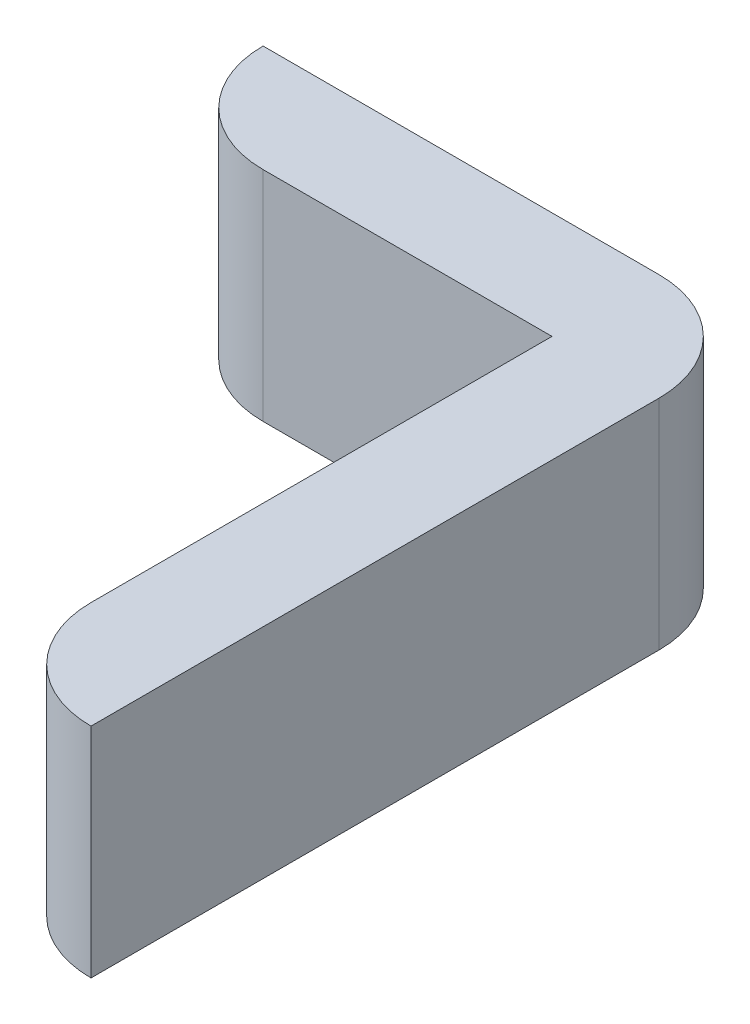
ISO-10303-21;
HEADER;
FILE_DESCRIPTION(('STEP AP214'),'2;1');
FILE_NAME('part.step','',(''),(''),'','','');
FILE_SCHEMA(('AUTOMOTIVE_DESIGN { 1 0 10303 214 1 1 1 1 }'));
ENDSEC;
DATA;
#1=APPLICATION_CONTEXT('core data for automotive mechanical design processes');
#2=APPLICATION_PROTOCOL_DEFINITION('international standard','automotive_design',2000,#1);
#3=PRODUCT_CONTEXT('',#1,'mechanical');
#4=PRODUCT('Part','Part','',(#3));
#5=PRODUCT_RELATED_PRODUCT_CATEGORY('part','',(#4));
#6=PRODUCT_DEFINITION_FORMATION('','',#4);
#7=PRODUCT_DEFINITION_CONTEXT('part definition',#1,'design');
#8=PRODUCT_DEFINITION('design','',#6,#7);
#9=PRODUCT_DEFINITION_SHAPE('','',#8);
#10=(LENGTH_UNIT() NAMED_UNIT(*) SI_UNIT(.MILLI.,.METRE.));
#11=(NAMED_UNIT(*) PLANE_ANGLE_UNIT() SI_UNIT($,.RADIAN.));
#12=(NAMED_UNIT(*) SI_UNIT($,.STERADIAN.) SOLID_ANGLE_UNIT());
#13=UNCERTAINTY_MEASURE_WITH_UNIT(LENGTH_MEASURE(1.E-05),#10,'distance_accuracy_value','');
#14=(GEOMETRIC_REPRESENTATION_CONTEXT(3) GLOBAL_UNCERTAINTY_ASSIGNED_CONTEXT((#13)) GLOBAL_UNIT_ASSIGNED_CONTEXT((#10,
#11,#12)) REPRESENTATION_CONTEXT('',''));
#15=CARTESIAN_POINT('',(0.,0.,0.));
#16=DIRECTION('',(0.,0.,1.));
#17=DIRECTION('',(1.,0.,0.));
#18=AXIS2_PLACEMENT_3D('',#15,#16,#17);
#19=CARTESIAN_POINT('',(-0.125,-2.2852,0.));
#20=DIRECTION('',(0.,-1.,0.));
#21=DIRECTION('',(0.,0.,-1.));
#22=AXIS2_PLACEMENT_3D('',#19,#20,#21);
#23=PLANE('',#22);
#24=DIRECTION('',(-1.,0.,0.));
#25=VECTOR('',#24,1.);
#26=CARTESIAN_POINT('',(0.125,-2.2852,0.25));
#27=LINE('',#26,#25);
#28=CARTESIAN_POINT('',(0.125,-2.2852,0.25));
#29=VERTEX_POINT('',#28);
#30=CARTESIAN_POINT('',(0.8,-2.2852,0.25));
#31=VERTEX_POINT('',#30);
#32=EDGE_CURVE('E102',#29,#31,#27,.F.);
#33=ORIENTED_EDGE('',*,*,#32,.T.);
#34=DIRECTION('',(0.,0.,-1.));
#35=VECTOR('',#34,1.);
#36=CARTESIAN_POINT('',(0.8,-2.2852,0.25));
#37=LINE('',#36,#35);
#38=CARTESIAN_POINT('',(0.8,-2.2852,1.327));
#39=VERTEX_POINT('',#38);
#40=EDGE_CURVE('E108',#31,#39,#37,.F.);
#41=ORIENTED_EDGE('',*,*,#40,.T.);
#42=CARTESIAN_POINT('',(1.05,-2.2852,1.327));
#43=DIRECTION('',(0.,-1.,0.));
#44=DIRECTION('',(0.,0.,-1.));
#45=AXIS2_PLACEMENT_3D('',#42,#43,#44);
#46=CIRCLE('',#45,0.25);
#47=CARTESIAN_POINT('',(1.05,-2.2852,1.577));
#48=VERTEX_POINT('',#47);
#49=EDGE_CURVE('E80',#48,#39,#46,.T.);
#50=ORIENTED_EDGE('',*,*,#49,.F.);
#51=DIRECTION('',(0.,0.,1.));
#52=VECTOR('',#51,1.);
#53=CARTESIAN_POINT('',(1.05,-2.2852,1.577));
#54=LINE('',#53,#52);
#55=CARTESIAN_POINT('',(1.05,-2.2852,0.25));
#56=VERTEX_POINT('',#55);
#57=EDGE_CURVE('E75',#48,#56,#54,.F.);
#58=ORIENTED_EDGE('',*,*,#57,.T.);
#59=CARTESIAN_POINT('',(0.8,-2.2852,0.25));
#60=DIRECTION('',(0.,-1.,0.));
#61=DIRECTION('',(0.,0.,-1.));
#62=AXIS2_PLACEMENT_3D('',#59,#60,#61);
#63=CIRCLE('',#62,0.25);
#64=CARTESIAN_POINT('',(0.8,-2.2852,0.));
#65=VERTEX_POINT('',#64);
#66=EDGE_CURVE('E19',#65,#56,#63,.T.);
#67=ORIENTED_EDGE('',*,*,#66,.F.);
#68=DIRECTION('',(1.,0.,0.));
#69=VECTOR('',#68,1.);
#70=CARTESIAN_POINT('',(0.8,-2.2852,0.));
#71=LINE('',#70,#69);
#72=CARTESIAN_POINT('',(-0.125,-2.2852,0.));
#73=VERTEX_POINT('',#72);
#74=EDGE_CURVE('E70',#65,#73,#71,.F.);
#75=ORIENTED_EDGE('',*,*,#74,.T.);
#76=CARTESIAN_POINT('',(0.125,-2.2852,0.));
#77=DIRECTION('',(0.,-1.,0.));
#78=DIRECTION('',(0.,0.,-1.));
#79=AXIS2_PLACEMENT_3D('',#76,#77,#78);
#80=CIRCLE('',#79,0.25);
#81=EDGE_CURVE('E121',#29,#73,#80,.T.);
#82=ORIENTED_EDGE('',*,*,#81,.F.);
#83=EDGE_LOOP('',(#33,#41,#50,#58,#67,#75,#82));
#84=FACE_BOUND('',#83,.T.);
#85=ADVANCED_FACE('F16',(#84),#23,.F.);
#86=CARTESIAN_POINT('',(0.8,-2.7948,0.));
#87=DIRECTION('',(0.,0.,1.));
#88=DIRECTION('',(1.,0.,0.));
#89=AXIS2_PLACEMENT_3D('',#86,#87,#88);
#90=PLANE('',#89);
#91=DIRECTION('',(0.,-1.,0.));
#92=VECTOR('',#91,1.);
#93=CARTESIAN_POINT('',(-0.125,-2.7948,0.));
#94=LINE('',#93,#92);
#95=CARTESIAN_POINT('',(-0.125,-2.7948,0.));
#96=VERTEX_POINT('',#95);
#97=EDGE_CURVE('E123',#73,#96,#94,.T.);
#98=ORIENTED_EDGE('',*,*,#97,.F.);
#99=ORIENTED_EDGE('',*,*,#74,.F.);
#100=DIRECTION('',(0.,-1.,0.));
#101=VECTOR('',#100,1.);
#102=CARTESIAN_POINT('',(0.8,-2.7948,0.));
#103=LINE('',#102,#101);
#104=CARTESIAN_POINT('',(0.8,-2.7948,0.));
#105=VERTEX_POINT('',#104);
#106=EDGE_CURVE('E92',#105,#65,#103,.F.);
#107=ORIENTED_EDGE('',*,*,#106,.F.);
#108=DIRECTION('',(1.,0.,0.));
#109=VECTOR('',#108,1.);
#110=CARTESIAN_POINT('',(-0.125,-2.7948,0.));
#111=LINE('',#110,#109);
#112=EDGE_CURVE('E120',#96,#105,#111,.T.);
#113=ORIENTED_EDGE('',*,*,#112,.F.);
#114=EDGE_LOOP('',(#98,#99,#107,#113));
#115=FACE_BOUND('',#114,.T.);
#116=ADVANCED_FACE('F158',(#115),#90,.F.);
#117=CARTESIAN_POINT('',(0.8,-2.7948,0.25));
#118=DIRECTION('',(0.,-1.,0.));
#119=DIRECTION('',(0.,0.,-1.));
#120=AXIS2_PLACEMENT_3D('',#117,#118,#119);
#121=CYLINDRICAL_SURFACE('',#120,0.25);
#122=ORIENTED_EDGE('',*,*,#66,.T.);
#123=DIRECTION('',(0.,1.,0.));
#124=VECTOR('',#123,1.);
#125=CARTESIAN_POINT('',(1.05,-2.7948,0.25));
#126=LINE('',#125,#124);
#127=CARTESIAN_POINT('',(1.05,-2.7948,0.25));
#128=VERTEX_POINT('',#127);
#129=EDGE_CURVE('E86',#56,#128,#126,.F.);
#130=ORIENTED_EDGE('',*,*,#129,.T.);
#131=CARTESIAN_POINT('',(0.8,-2.7948,0.25));
#132=DIRECTION('',(0.,-1.,0.));
#133=DIRECTION('',(0.,0.,-1.));
#134=AXIS2_PLACEMENT_3D('',#131,#132,#133);
#135=CIRCLE('',#134,0.25);
#136=EDGE_CURVE('E118',#105,#128,#135,.T.);
#137=ORIENTED_EDGE('',*,*,#136,.F.);
#138=ORIENTED_EDGE('',*,*,#106,.T.);
#139=EDGE_LOOP('',(#122,#130,#137,#138));
#140=FACE_BOUND('',#139,.T.);
#141=ADVANCED_FACE('F89',(#140),#121,.T.);
#142=CARTESIAN_POINT('',(1.05,-2.7948,1.577));
#143=DIRECTION('',(-1.,0.,0.));
#144=DIRECTION('',(0.,0.,1.));
#145=AXIS2_PLACEMENT_3D('',#142,#143,#144);
#146=PLANE('',#145);
#147=DIRECTION('',(0.,-1.,0.));
#148=VECTOR('',#147,1.);
#149=CARTESIAN_POINT('',(1.05,-2.7948,1.577));
#150=LINE('',#149,#148);
#151=CARTESIAN_POINT('',(1.05,-2.7948,1.577));
#152=VERTEX_POINT('',#151);
#153=EDGE_CURVE('E85',#152,#48,#150,.F.);
#154=ORIENTED_EDGE('',*,*,#153,.F.);
#155=DIRECTION('',(0.,0.,-1.));
#156=VECTOR('',#155,1.);
#157=CARTESIAN_POINT('',(1.05,-2.7948,0.));
#158=LINE('',#157,#156);
#159=EDGE_CURVE('E94',#128,#152,#158,.F.);
#160=ORIENTED_EDGE('',*,*,#159,.F.);
#161=ORIENTED_EDGE('',*,*,#129,.F.);
#162=ORIENTED_EDGE('',*,*,#57,.F.);
#163=EDGE_LOOP('',(#154,#160,#161,#162));
#164=FACE_BOUND('',#163,.T.);
#165=ADVANCED_FACE('F93',(#164),#146,.F.);
#166=CARTESIAN_POINT('',(1.05,-2.7948,1.327));
#167=DIRECTION('',(0.,-1.,0.));
#168=DIRECTION('',(0.,0.,-1.));
#169=AXIS2_PLACEMENT_3D('',#166,#167,#168);
#170=CYLINDRICAL_SURFACE('',#169,0.25);
#171=ORIENTED_EDGE('',*,*,#49,.T.);
#172=DIRECTION('',(0.,1.,0.));
#173=VECTOR('',#172,1.);
#174=CARTESIAN_POINT('',(0.8,-2.7948,1.327));
#175=LINE('',#174,#173);
#176=CARTESIAN_POINT('',(0.8,-2.7948,1.327));
#177=VERTEX_POINT('',#176);
#178=EDGE_CURVE('E105',#39,#177,#175,.F.);
#179=ORIENTED_EDGE('',*,*,#178,.T.);
#180=CARTESIAN_POINT('',(1.05,-2.7948,1.327));
#181=DIRECTION('',(0.,-1.,0.));
#182=DIRECTION('',(0.,0.,-1.));
#183=AXIS2_PLACEMENT_3D('',#180,#181,#182);
#184=CIRCLE('',#183,0.25);
#185=EDGE_CURVE('E114',#152,#177,#184,.T.);
#186=ORIENTED_EDGE('',*,*,#185,.F.);
#187=ORIENTED_EDGE('',*,*,#153,.T.);
#188=EDGE_LOOP('',(#171,#179,#186,#187));
#189=FACE_BOUND('',#188,.T.);
#190=ADVANCED_FACE('F127',(#189),#170,.T.);
#191=CARTESIAN_POINT('',(0.8,-2.7948,0.25));
#192=DIRECTION('',(1.,0.,0.));
#193=DIRECTION('',(0.,0.,-1.));
#194=AXIS2_PLACEMENT_3D('',#191,#192,#193);
#195=PLANE('',#194);
#196=ORIENTED_EDGE('',*,*,#178,.F.);
#197=ORIENTED_EDGE('',*,*,#40,.F.);
#198=DIRECTION('',(0.,1.,0.));
#199=VECTOR('',#198,1.);
#200=CARTESIAN_POINT('',(0.8,-2.7948,0.25));
#201=LINE('',#200,#199);
#202=CARTESIAN_POINT('',(0.8,-2.7948,0.25));
#203=VERTEX_POINT('',#202);
#204=EDGE_CURVE('E104',#31,#203,#201,.F.);
#205=ORIENTED_EDGE('',*,*,#204,.T.);
#206=DIRECTION('',(0.,0.,-1.));
#207=VECTOR('',#206,1.);
#208=CARTESIAN_POINT('',(0.8,-2.7948,0.));
#209=LINE('',#208,#207);
#210=EDGE_CURVE('E117',#177,#203,#209,.T.);
#211=ORIENTED_EDGE('',*,*,#210,.F.);
#212=EDGE_LOOP('',(#196,#197,#205,#211));
#213=FACE_BOUND('',#212,.T.);
#214=ADVANCED_FACE('F150',(#213),#195,.F.);
#215=CARTESIAN_POINT('',(0.125,-2.7948,0.25));
#216=DIRECTION('',(0.,0.,-1.));
#217=DIRECTION('',(-1.,0.,0.));
#218=AXIS2_PLACEMENT_3D('',#215,#216,#217);
#219=PLANE('',#218);
#220=ORIENTED_EDGE('',*,*,#204,.F.);
#221=ORIENTED_EDGE('',*,*,#32,.F.);
#222=DIRECTION('',(0.,-1.,0.));
#223=VECTOR('',#222,1.);
#224=CARTESIAN_POINT('',(0.125,-2.7948,0.25));
#225=LINE('',#224,#223);
#226=CARTESIAN_POINT('',(0.125,-2.7948,0.25));
#227=VERTEX_POINT('',#226);
#228=EDGE_CURVE('E34',#227,#29,#225,.F.);
#229=ORIENTED_EDGE('',*,*,#228,.F.);
#230=DIRECTION('',(1.,0.,0.));
#231=VECTOR('',#230,1.);
#232=CARTESIAN_POINT('',(-0.125,-2.7948,0.25));
#233=LINE('',#232,#231);
#234=EDGE_CURVE('E25',#203,#227,#233,.F.);
#235=ORIENTED_EDGE('',*,*,#234,.F.);
#236=EDGE_LOOP('',(#220,#221,#229,#235));
#237=FACE_BOUND('',#236,.T.);
#238=ADVANCED_FACE('F151',(#237),#219,.F.);
#239=CARTESIAN_POINT('',(0.125,-2.7948,0.));
#240=DIRECTION('',(0.,-1.,0.));
#241=DIRECTION('',(0.,0.,-1.));
#242=AXIS2_PLACEMENT_3D('',#239,#240,#241);
#243=CYLINDRICAL_SURFACE('',#242,0.25);
#244=ORIENTED_EDGE('',*,*,#81,.T.);
#245=ORIENTED_EDGE('',*,*,#97,.T.);
#246=CARTESIAN_POINT('',(0.125,-2.7948,0.));
#247=DIRECTION('',(0.,-1.,0.));
#248=DIRECTION('',(0.,0.,-1.));
#249=AXIS2_PLACEMENT_3D('',#246,#247,#248);
#250=CIRCLE('',#249,0.25);
#251=EDGE_CURVE('E11',#227,#96,#250,.T.);
#252=ORIENTED_EDGE('',*,*,#251,.F.);
#253=ORIENTED_EDGE('',*,*,#228,.T.);
#254=EDGE_LOOP('',(#244,#245,#252,#253));
#255=FACE_BOUND('',#254,.T.);
#256=ADVANCED_FACE('F156',(#255),#243,.T.);
#257=CARTESIAN_POINT('',(-0.125,-2.7948,0.));
#258=DIRECTION('',(0.,-1.,0.));
#259=DIRECTION('',(0.,0.,-1.));
#260=AXIS2_PLACEMENT_3D('',#257,#258,#259);
#261=PLANE('',#260);
#262=ORIENTED_EDGE('',*,*,#234,.T.);
#263=ORIENTED_EDGE('',*,*,#251,.T.);
#264=ORIENTED_EDGE('',*,*,#112,.T.);
#265=ORIENTED_EDGE('',*,*,#136,.T.);
#266=ORIENTED_EDGE('',*,*,#159,.T.);
#267=ORIENTED_EDGE('',*,*,#185,.T.);
#268=ORIENTED_EDGE('',*,*,#210,.T.);
#269=EDGE_LOOP('',(#262,#263,#264,#265,#266,#267,#268));
#270=FACE_BOUND('',#269,.T.);
#271=ADVANCED_FACE('F132',(#270),#261,.T.);
#272=CLOSED_SHELL('',(#85,#116,#141,#165,#190,#214,#238,#256,#271));
#273=MANIFOLD_SOLID_BREP('B1',#272);
#274=ADVANCED_BREP_SHAPE_REPRESENTATION('',(#18,#273),#14);
#275=SHAPE_DEFINITION_REPRESENTATION(#9,#274);
ENDSEC;
END-ISO-10303-21;
